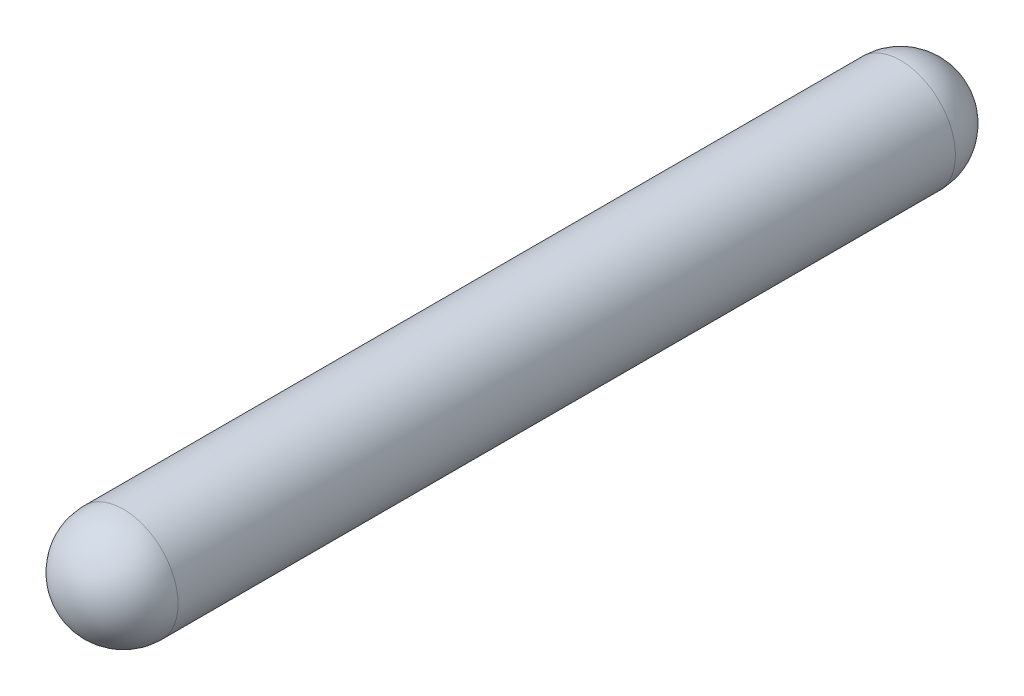
ISO-10303-21;
HEADER;
FILE_DESCRIPTION(('STEP AP214'),'2;1');
FILE_NAME('part.step','',(''),(''),'','','');
FILE_SCHEMA(('AUTOMOTIVE_DESIGN { 1 0 10303 214 1 1 1 1 }'));
ENDSEC;
DATA;
#1=APPLICATION_CONTEXT('core data for automotive mechanical design processes');
#2=APPLICATION_PROTOCOL_DEFINITION('international standard','automotive_design',2000,#1);
#3=PRODUCT_CONTEXT('',#1,'mechanical');
#4=PRODUCT('Part','Part','',(#3));
#5=PRODUCT_RELATED_PRODUCT_CATEGORY('part','',(#4));
#6=PRODUCT_DEFINITION_FORMATION('','',#4);
#7=PRODUCT_DEFINITION_CONTEXT('part definition',#1,'design');
#8=PRODUCT_DEFINITION('design','',#6,#7);
#9=PRODUCT_DEFINITION_SHAPE('','',#8);
#10=(LENGTH_UNIT() NAMED_UNIT(*) SI_UNIT(.MILLI.,.METRE.));
#11=(NAMED_UNIT(*) PLANE_ANGLE_UNIT() SI_UNIT($,.RADIAN.));
#12=(NAMED_UNIT(*) SI_UNIT($,.STERADIAN.) SOLID_ANGLE_UNIT());
#13=UNCERTAINTY_MEASURE_WITH_UNIT(LENGTH_MEASURE(1.E-05),#10,'distance_accuracy_value','');
#14=(GEOMETRIC_REPRESENTATION_CONTEXT(3) GLOBAL_UNCERTAINTY_ASSIGNED_CONTEXT((#13)) GLOBAL_UNIT_ASSIGNED_CONTEXT((#10,
#11,#12)) REPRESENTATION_CONTEXT('',''));
#15=CARTESIAN_POINT('',(0.,0.,0.));
#16=DIRECTION('',(0.,0.,1.));
#17=DIRECTION('',(1.,0.,0.));
#18=AXIS2_PLACEMENT_3D('',#15,#16,#17);
#19=CARTESIAN_POINT('',(5.08,0.,-3.));
#20=DIRECTION('',(1.,0.,0.));
#21=DIRECTION('',(0.,-1.,0.));
#22=AXIS2_PLACEMENT_3D('',#19,#20,#21);
#23=SPHERICAL_SURFACE('',#22,0.458);
#24=CARTESIAN_POINT('',(5.08,0.,-3.));
#25=DIRECTION('',(0.,0.,1.));
#26=DIRECTION('',(1.,0.,0.));
#27=AXIS2_PLACEMENT_3D('',#24,#25,#26);
#28=CIRCLE('',#27,0.458);
#29=CARTESIAN_POINT('',(5.538,0.,-3.));
#30=VERTEX_POINT('',#29);
#31=CARTESIAN_POINT('',(4.622,0.,-3.));
#32=VERTEX_POINT('',#31);
#33=EDGE_CURVE('E42',#30,#32,#28,.T.);
#34=ORIENTED_EDGE('',*,*,#33,.F.);
#35=CARTESIAN_POINT('',(5.08,0.,-3.));
#36=DIRECTION('',(0.,0.,1.));
#37=DIRECTION('',(1.,0.,0.));
#38=AXIS2_PLACEMENT_3D('',#35,#36,#37);
#39=CIRCLE('',#38,0.458);
#40=EDGE_CURVE('E26',#32,#30,#39,.T.);
#41=ORIENTED_EDGE('',*,*,#40,.F.);
#42=EDGE_LOOP('',(#34,#41));
#43=FACE_BOUND('',#42,.T.);
#44=ADVANCED_FACE('F17',(#43),#23,.T.);
#45=CARTESIAN_POINT('',(5.08,0.,3.5));
#46=DIRECTION('',(1.,0.,0.));
#47=DIRECTION('',(0.,1.,0.));
#48=AXIS2_PLACEMENT_3D('',#45,#46,#47);
#49=SPHERICAL_SURFACE('',#48,0.458);
#50=CARTESIAN_POINT('',(5.08,0.,3.5));
#51=DIRECTION('',(0.,0.,1.));
#52=DIRECTION('',(1.,0.,0.));
#53=AXIS2_PLACEMENT_3D('',#50,#51,#52);
#54=CIRCLE('',#53,0.458);
#55=CARTESIAN_POINT('',(5.538,0.,3.5));
#56=VERTEX_POINT('',#55);
#57=CARTESIAN_POINT('',(4.622,0.,3.5));
#58=VERTEX_POINT('',#57);
#59=EDGE_CURVE('E11',#56,#58,#54,.F.);
#60=ORIENTED_EDGE('',*,*,#59,.F.);
#61=CARTESIAN_POINT('',(5.08,0.,3.5));
#62=DIRECTION('',(0.,0.,1.));
#63=DIRECTION('',(1.,0.,0.));
#64=AXIS2_PLACEMENT_3D('',#61,#62,#63);
#65=CIRCLE('',#64,0.458);
#66=EDGE_CURVE('E34',#58,#56,#65,.F.);
#67=ORIENTED_EDGE('',*,*,#66,.F.);
#68=EDGE_LOOP('',(#60,#67));
#69=FACE_BOUND('',#68,.T.);
#70=ADVANCED_FACE('F49',(#69),#49,.T.);
#71=CARTESIAN_POINT('',(5.08,0.,-3.));
#72=DIRECTION('',(0.,0.,1.));
#73=DIRECTION('',(1.,0.,0.));
#74=AXIS2_PLACEMENT_3D('',#71,#72,#73);
#75=CYLINDRICAL_SURFACE('',#74,0.458);
#76=ORIENTED_EDGE('',*,*,#66,.T.);
#77=ORIENTED_EDGE('',*,*,#59,.T.);
#78=EDGE_LOOP('',(#76,#77));
#79=FACE_BOUND('',#78,.T.);
#80=ORIENTED_EDGE('',*,*,#40,.T.);
#81=ORIENTED_EDGE('',*,*,#33,.T.);
#82=EDGE_LOOP('',(#80,#81));
#83=FACE_BOUND('',#82,.T.);
#84=ADVANCED_FACE('F45',(#79,#83),#75,.T.);
#85=CLOSED_SHELL('',(#44,#70,#84));
#86=MANIFOLD_SOLID_BREP('B1',#85);
#87=ADVANCED_BREP_SHAPE_REPRESENTATION('',(#18,#86),#14);
#88=SHAPE_DEFINITION_REPRESENTATION(#9,#87);
ENDSEC;
END-ISO-10303-21;
